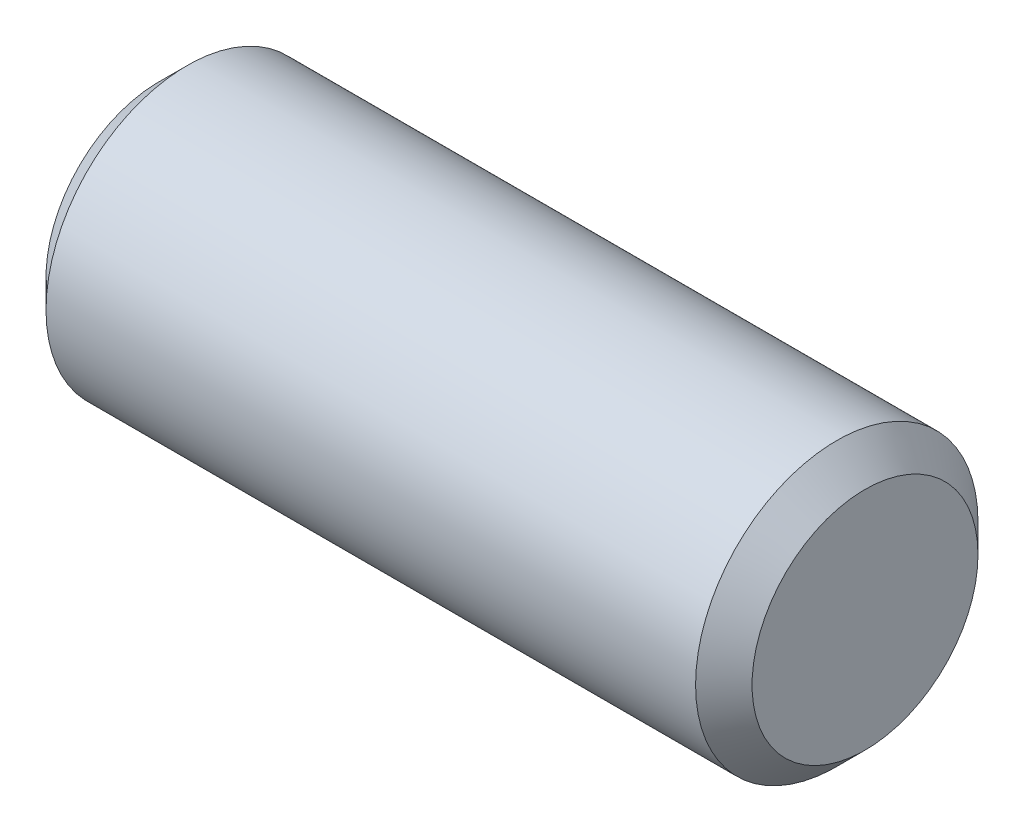
ISO-10303-21;
HEADER;
FILE_DESCRIPTION(('STEP AP214'),'2;1');
FILE_NAME('part.step','',(''),(''),'','','');
FILE_SCHEMA(('AUTOMOTIVE_DESIGN { 1 0 10303 214 1 1 1 1 }'));
ENDSEC;
DATA;
#1=APPLICATION_CONTEXT('core data for automotive mechanical design processes');
#2=APPLICATION_PROTOCOL_DEFINITION('international standard','automotive_design',2000,#1);
#3=PRODUCT_CONTEXT('',#1,'mechanical');
#4=PRODUCT('Part','Part','',(#3));
#5=PRODUCT_RELATED_PRODUCT_CATEGORY('part','',(#4));
#6=PRODUCT_DEFINITION_FORMATION('','',#4);
#7=PRODUCT_DEFINITION_CONTEXT('part definition',#1,'design');
#8=PRODUCT_DEFINITION('design','',#6,#7);
#9=PRODUCT_DEFINITION_SHAPE('','',#8);
#10=(LENGTH_UNIT() NAMED_UNIT(*) SI_UNIT(.MILLI.,.METRE.));
#11=(NAMED_UNIT(*) PLANE_ANGLE_UNIT() SI_UNIT($,.RADIAN.));
#12=(NAMED_UNIT(*) SI_UNIT($,.STERADIAN.) SOLID_ANGLE_UNIT());
#13=UNCERTAINTY_MEASURE_WITH_UNIT(LENGTH_MEASURE(1.E-05),#10,'distance_accuracy_value','');
#14=(GEOMETRIC_REPRESENTATION_CONTEXT(3) GLOBAL_UNCERTAINTY_ASSIGNED_CONTEXT((#13)) GLOBAL_UNIT_ASSIGNED_CONTEXT((#10,
#11,#12)) REPRESENTATION_CONTEXT('',''));
#15=CARTESIAN_POINT('',(0.,0.,0.));
#16=DIRECTION('',(0.,0.,1.));
#17=DIRECTION('',(1.,0.,0.));
#18=AXIS2_PLACEMENT_3D('',#15,#16,#17);
#19=CARTESIAN_POINT('',(-7.9375,0.,0.));
#20=DIRECTION('',(1.,0.,0.));
#21=DIRECTION('',(0.,0.,-1.));
#22=AXIS2_PLACEMENT_3D('',#19,#20,#21);
#23=CYLINDRICAL_SURFACE('',#22,3.175);
#24=CARTESIAN_POINT('',(7.3025,0.,0.));
#25=DIRECTION('',(1.,0.,0.));
#26=DIRECTION('',(0.,0.,-1.));
#27=AXIS2_PLACEMENT_3D('',#24,#25,#26);
#28=CIRCLE('',#27,3.175);
#29=CARTESIAN_POINT('',(7.3025,0.,-3.175));
#30=VERTEX_POINT('',#29);
#31=EDGE_CURVE('E40',#30,#30,#28,.F.);
#32=ORIENTED_EDGE('',*,*,#31,.T.);
#33=EDGE_LOOP('',(#32));
#34=FACE_BOUND('',#33,.T.);
#35=CARTESIAN_POINT('',(-7.3025,0.,0.));
#36=DIRECTION('',(1.,0.,0.));
#37=DIRECTION('',(0.,0.,-1.));
#38=AXIS2_PLACEMENT_3D('',#35,#36,#37);
#39=CIRCLE('',#38,3.175);
#40=CARTESIAN_POINT('',(-7.3025,0.,-3.175));
#41=VERTEX_POINT('',#40);
#42=EDGE_CURVE('E44',#41,#41,#39,.T.);
#43=ORIENTED_EDGE('',*,*,#42,.T.);
#44=EDGE_LOOP('',(#43));
#45=FACE_BOUND('',#44,.T.);
#46=ADVANCED_FACE('F33',(#34,#45),#23,.T.);
#47=CARTESIAN_POINT('',(-7.9375,0.,0.));
#48=DIRECTION('',(1.,0.,0.));
#49=DIRECTION('',(0.,0.,-1.));
#50=AXIS2_PLACEMENT_3D('',#47,#48,#49);
#51=PLANE('',#50);
#52=CARTESIAN_POINT('',(-7.9375,0.,0.));
#53=DIRECTION('',(1.,0.,0.));
#54=DIRECTION('',(0.,0.,-1.));
#55=AXIS2_PLACEMENT_3D('',#52,#53,#54);
#56=CIRCLE('',#55,2.54);
#57=CARTESIAN_POINT('',(-7.9375,0.,-2.54));
#58=VERTEX_POINT('',#57);
#59=EDGE_CURVE('E10',#58,#58,#56,.F.);
#60=ORIENTED_EDGE('',*,*,#59,.T.);
#61=EDGE_LOOP('',(#60));
#62=FACE_BOUND('',#61,.T.);
#63=ADVANCED_FACE('F64',(#62),#51,.F.);
#64=CARTESIAN_POINT('',(7.9375,0.,0.));
#65=DIRECTION('',(1.,0.,0.));
#66=DIRECTION('',(0.,0.,-1.));
#67=AXIS2_PLACEMENT_3D('',#64,#65,#66);
#68=PLANE('',#67);
#69=CARTESIAN_POINT('',(7.9375,0.,0.));
#70=DIRECTION('',(1.,0.,0.));
#71=DIRECTION('',(0.,0.,-1.));
#72=AXIS2_PLACEMENT_3D('',#69,#70,#71);
#73=CIRCLE('',#72,2.54);
#74=CARTESIAN_POINT('',(7.9375,0.,-2.54));
#75=VERTEX_POINT('',#74);
#76=EDGE_CURVE('E48',#75,#75,#73,.T.);
#77=ORIENTED_EDGE('',*,*,#76,.T.);
#78=EDGE_LOOP('',(#77));
#79=FACE_BOUND('',#78,.T.);
#80=ADVANCED_FACE('F54',(#79),#68,.T.);
#81=CARTESIAN_POINT('',(7.9375,0.,0.));
#82=DIRECTION('',(-1.,0.,0.));
#83=DIRECTION('',(0.,0.,1.));
#84=AXIS2_PLACEMENT_3D('',#81,#82,#83);
#85=CONICAL_SURFACE('',#84,2.54,0.785398163397448);
#86=ORIENTED_EDGE('',*,*,#31,.F.);
#87=EDGE_LOOP('',(#86));
#88=FACE_BOUND('',#87,.T.);
#89=ORIENTED_EDGE('',*,*,#76,.F.);
#90=EDGE_LOOP('',(#89));
#91=FACE_BOUND('',#90,.T.);
#92=ADVANCED_FACE('F56',(#88,#91),#85,.T.);
#93=CARTESIAN_POINT('',(-7.3025,0.,0.));
#94=DIRECTION('',(1.,0.,0.));
#95=DIRECTION('',(0.,0.,-1.));
#96=AXIS2_PLACEMENT_3D('',#93,#94,#95);
#97=CONICAL_SURFACE('',#96,3.175,0.785398163397449);
#98=ORIENTED_EDGE('',*,*,#59,.F.);
#99=EDGE_LOOP('',(#98));
#100=FACE_BOUND('',#99,.T.);
#101=ORIENTED_EDGE('',*,*,#42,.F.);
#102=EDGE_LOOP('',(#101));
#103=FACE_BOUND('',#102,.T.);
#104=ADVANCED_FACE('F35',(#100,#103),#97,.T.);
#105=CLOSED_SHELL('',(#46,#63,#80,#92,#104));
#106=MANIFOLD_SOLID_BREP('B2',#105);
#107=ADVANCED_BREP_SHAPE_REPRESENTATION('',(#18,#106),#14);
#108=SHAPE_DEFINITION_REPRESENTATION(#9,#107);
ENDSEC;
END-ISO-10303-21;
